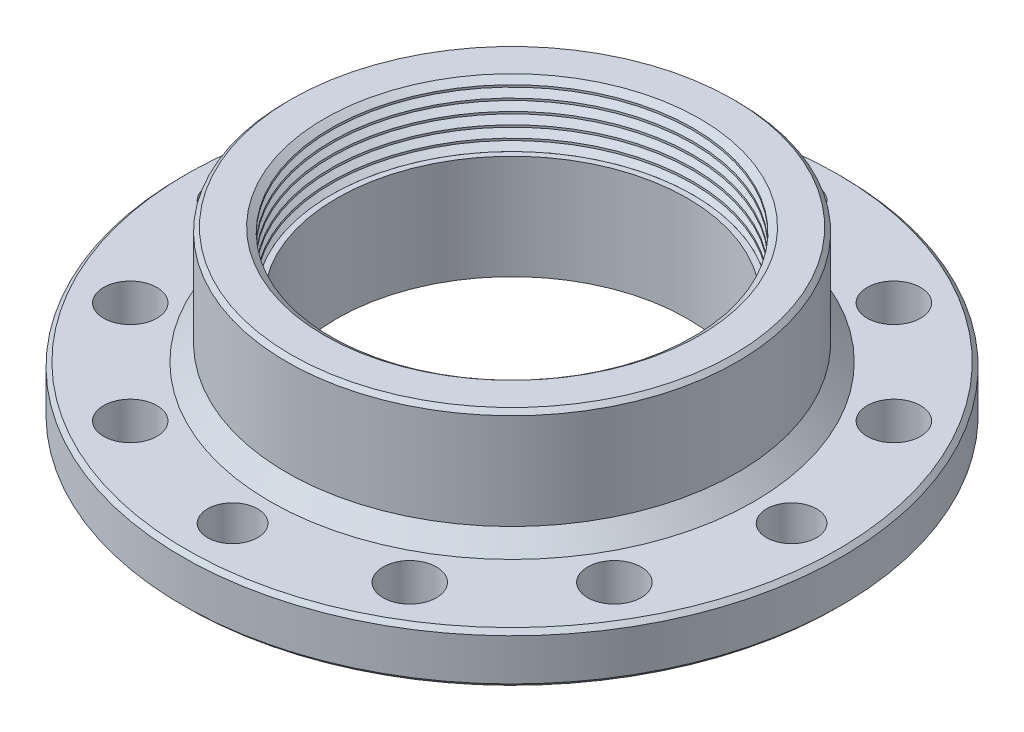
ISO-10303-21;
HEADER;
FILE_DESCRIPTION(('STEP AP214'),'2;1');
FILE_NAME('part.step','',(''),(''),'','','');
FILE_SCHEMA(('AUTOMOTIVE_DESIGN { 1 0 10303 214 1 1 1 1 }'));
ENDSEC;
DATA;
#1=APPLICATION_CONTEXT('core data for automotive mechanical design processes');
#2=APPLICATION_PROTOCOL_DEFINITION('international standard','automotive_design',2000,#1);
#3=PRODUCT_CONTEXT('',#1,'mechanical');
#4=PRODUCT('Part','Part','',(#3));
#5=PRODUCT_RELATED_PRODUCT_CATEGORY('part','',(#4));
#6=PRODUCT_DEFINITION_FORMATION('','',#4);
#7=PRODUCT_DEFINITION_CONTEXT('part definition',#1,'design');
#8=PRODUCT_DEFINITION('design','',#6,#7);
#9=PRODUCT_DEFINITION_SHAPE('','',#8);
#10=(LENGTH_UNIT() NAMED_UNIT(*) SI_UNIT(.MILLI.,.METRE.));
#11=(NAMED_UNIT(*) PLANE_ANGLE_UNIT() SI_UNIT($,.RADIAN.));
#12=(NAMED_UNIT(*) SI_UNIT($,.STERADIAN.) SOLID_ANGLE_UNIT());
#13=UNCERTAINTY_MEASURE_WITH_UNIT(LENGTH_MEASURE(1.E-05),#10,'distance_accuracy_value','');
#14=(GEOMETRIC_REPRESENTATION_CONTEXT(3) GLOBAL_UNCERTAINTY_ASSIGNED_CONTEXT((#13)) GLOBAL_UNIT_ASSIGNED_CONTEXT((#10,
#11,#12)) REPRESENTATION_CONTEXT('',''));
#15=CARTESIAN_POINT('',(0.,0.,0.));
#16=DIRECTION('',(0.,0.,1.));
#17=DIRECTION('',(1.,0.,0.));
#18=AXIS2_PLACEMENT_3D('',#15,#16,#17);
#19=CARTESIAN_POINT('',(0.,12.5,0.));
#20=DIRECTION('',(0.,1.,0.));
#21=DIRECTION('',(0.,0.,1.00000000000001));
#22=AXIS2_PLACEMENT_3D('',#19,#20,#21);
#23=CYLINDRICAL_SURFACE('',#22,21.688);
#24=CARTESIAN_POINT('',(0.,12.5,0.));
#25=DIRECTION('',(0.,1.,0.));
#26=DIRECTION('',(0.,0.,1.00000000000001));
#27=AXIS2_PLACEMENT_3D('',#24,#25,#26);
#28=CIRCLE('',#27,21.688);
#29=CARTESIAN_POINT('',(0.,12.5,21.6880000000001));
#30=VERTEX_POINT('',#29);
#31=EDGE_CURVE('E57',#30,#30,#28,.T.);
#32=ORIENTED_EDGE('',*,*,#31,.F.);
#33=EDGE_LOOP('',(#32));
#34=FACE_BOUND('',#33,.T.);
#35=CARTESIAN_POINT('',(0.,12.5014314789737,0.));
#36=DIRECTION('',(0.,-1.,0.));
#37=DIRECTION('',(0.,0.,-1.00000000000001));
#38=AXIS2_PLACEMENT_3D('',#35,#36,#37);
#39=CIRCLE('',#38,21.688);
#40=CARTESIAN_POINT('',(0.,12.5014314789737,-21.6880000000001));
#41=VERTEX_POINT('',#40);
#42=EDGE_CURVE('E285',#41,#41,#39,.T.);
#43=ORIENTED_EDGE('',*,*,#42,.F.);
#44=EDGE_LOOP('',(#43));
#45=FACE_BOUND('',#44,.T.);
#46=ADVANCED_FACE('F32',(#34,#45),#23,.F.);
#47=CARTESIAN_POINT('',(0.,13.8874314789737,0.));
#48=DIRECTION('',(0.,-1.,0.));
#49=DIRECTION('',(0.,0.,-1.00000000000001));
#50=AXIS2_PLACEMENT_3D('',#47,#48,#49);
#51=CIRCLE('',#50,21.688);
#52=CARTESIAN_POINT('',(0.,13.8874314789737,-21.6880000000001));
#53=VERTEX_POINT('',#52);
#54=EDGE_CURVE('E297',#53,#53,#51,.T.);
#55=ORIENTED_EDGE('',*,*,#54,.F.);
#56=EDGE_LOOP('',(#55));
#57=FACE_BOUND('',#56,.T.);
#58=CARTESIAN_POINT('',(0.,13.6385685210263,0.));
#59=DIRECTION('',(0.,-1.,0.));
#60=DIRECTION('',(0.,0.,-1.00000000000001));
#61=AXIS2_PLACEMENT_3D('',#58,#59,#60);
#62=CIRCLE('',#61,21.688);
#63=CARTESIAN_POINT('',(0.,13.6385685210263,-21.6880000000001));
#64=VERTEX_POINT('',#63);
#65=EDGE_CURVE('E283',#64,#64,#62,.T.);
#66=ORIENTED_EDGE('',*,*,#65,.T.);
#67=EDGE_LOOP('',(#66));
#68=FACE_BOUND('',#67,.T.);
#69=ADVANCED_FACE('F184',(#57,#68),#23,.F.);
#70=CARTESIAN_POINT('',(0.,15.2734314789737,0.));
#71=DIRECTION('',(0.,-1.,0.));
#72=DIRECTION('',(0.,0.,-1.00000000000001));
#73=AXIS2_PLACEMENT_3D('',#70,#71,#72);
#74=CIRCLE('',#73,21.688);
#75=CARTESIAN_POINT('',(0.,15.2734314789737,-21.6880000000001));
#76=VERTEX_POINT('',#75);
#77=EDGE_CURVE('E306',#76,#76,#74,.T.);
#78=ORIENTED_EDGE('',*,*,#77,.F.);
#79=EDGE_LOOP('',(#78));
#80=FACE_BOUND('',#79,.T.);
#81=CARTESIAN_POINT('',(0.,15.0245685210263,0.));
#82=DIRECTION('',(0.,-1.,0.));
#83=DIRECTION('',(0.,0.,-1.00000000000001));
#84=AXIS2_PLACEMENT_3D('',#81,#82,#83);
#85=CIRCLE('',#84,21.688);
#86=CARTESIAN_POINT('',(0.,15.0245685210263,-21.6880000000001));
#87=VERTEX_POINT('',#86);
#88=EDGE_CURVE('E294',#87,#87,#85,.T.);
#89=ORIENTED_EDGE('',*,*,#88,.T.);
#90=EDGE_LOOP('',(#89));
#91=FACE_BOUND('',#90,.T.);
#92=ADVANCED_FACE('F191',(#80,#91),#23,.F.);
#93=CARTESIAN_POINT('',(0.,16.6594314789737,0.));
#94=DIRECTION('',(0.,-1.,0.));
#95=DIRECTION('',(0.,0.,-1.00000000000001));
#96=AXIS2_PLACEMENT_3D('',#93,#94,#95);
#97=CIRCLE('',#96,21.688);
#98=CARTESIAN_POINT('',(0.,16.6594314789737,-21.6880000000001));
#99=VERTEX_POINT('',#98);
#100=EDGE_CURVE('E219',#99,#99,#97,.T.);
#101=ORIENTED_EDGE('',*,*,#100,.F.);
#102=EDGE_LOOP('',(#101));
#103=FACE_BOUND('',#102,.T.);
#104=CARTESIAN_POINT('',(0.,16.4105685210263,0.));
#105=DIRECTION('',(0.,-1.,0.));
#106=DIRECTION('',(0.,0.,-1.00000000000001));
#107=AXIS2_PLACEMENT_3D('',#104,#105,#106);
#108=CIRCLE('',#107,21.688);
#109=CARTESIAN_POINT('',(0.,16.4105685210263,-21.6880000000001));
#110=VERTEX_POINT('',#109);
#111=EDGE_CURVE('E303',#110,#110,#108,.T.);
#112=ORIENTED_EDGE('',*,*,#111,.T.);
#113=EDGE_LOOP('',(#112));
#114=FACE_BOUND('',#113,.T.);
#115=ADVANCED_FACE('F205',(#103,#114),#23,.F.);
#116=CARTESIAN_POINT('',(0.,18.0454314789737,0.));
#117=DIRECTION('',(0.,-1.,0.));
#118=DIRECTION('',(0.,0.,-1.00000000000001));
#119=AXIS2_PLACEMENT_3D('',#116,#117,#118);
#120=CIRCLE('',#119,21.688);
#121=CARTESIAN_POINT('',(0.,18.0454314789737,-21.6880000000001));
#122=VERTEX_POINT('',#121);
#123=EDGE_CURVE('E213',#122,#122,#120,.T.);
#124=ORIENTED_EDGE('',*,*,#123,.F.);
#125=EDGE_LOOP('',(#124));
#126=FACE_BOUND('',#125,.T.);
#127=CARTESIAN_POINT('',(0.,17.7965685210263,0.));
#128=DIRECTION('',(0.,-1.,0.));
#129=DIRECTION('',(0.,0.,-1.00000000000001));
#130=AXIS2_PLACEMENT_3D('',#127,#128,#129);
#131=CIRCLE('',#130,21.688);
#132=CARTESIAN_POINT('',(0.,17.7965685210263,-21.6880000000001));
#133=VERTEX_POINT('',#132);
#134=EDGE_CURVE('E312',#133,#133,#131,.T.);
#135=ORIENTED_EDGE('',*,*,#134,.T.);
#136=EDGE_LOOP('',(#135));
#137=FACE_BOUND('',#136,.T.);
#138=ADVANCED_FACE('F198',(#126,#137),#23,.F.);
#139=CARTESIAN_POINT('',(0.,19.4314314789737,0.));
#140=DIRECTION('',(0.,-1.,0.));
#141=DIRECTION('',(0.,0.,-1.00000000000001));
#142=AXIS2_PLACEMENT_3D('',#139,#140,#141);
#143=CIRCLE('',#142,21.688);
#144=CARTESIAN_POINT('',(0.,19.4314314789737,-21.6880000000001));
#145=VERTEX_POINT('',#144);
#146=EDGE_CURVE('E61',#145,#145,#143,.T.);
#147=ORIENTED_EDGE('',*,*,#146,.F.);
#148=EDGE_LOOP('',(#147));
#149=FACE_BOUND('',#148,.T.);
#150=CARTESIAN_POINT('',(0.,19.1825685210263,0.));
#151=DIRECTION('',(0.,-1.,0.));
#152=DIRECTION('',(0.,0.,-1.00000000000001));
#153=AXIS2_PLACEMENT_3D('',#150,#151,#152);
#154=CIRCLE('',#153,21.688);
#155=CARTESIAN_POINT('',(0.,19.1825685210263,-21.6880000000001));
#156=VERTEX_POINT('',#155);
#157=EDGE_CURVE('E211',#156,#156,#154,.T.);
#158=ORIENTED_EDGE('',*,*,#157,.T.);
#159=EDGE_LOOP('',(#158));
#160=FACE_BOUND('',#159,.T.);
#161=ADVANCED_FACE('F187',(#149,#160),#23,.F.);
#162=CARTESIAN_POINT('',(-25.9763261820386,20.,0.));
#163=DIRECTION('',(0.,-1.,0.));
#164=DIRECTION('',(0.,0.,-1.00000000000001));
#165=AXIS2_PLACEMENT_3D('',#162,#163,#164);
#166=PLANE('',#165);
#167=CARTESIAN_POINT('',(0.,20.,0.));
#168=DIRECTION('',(0.,-1.,0.));
#169=DIRECTION('',(0.,0.,-1.00000000000001));
#170=AXIS2_PLACEMENT_3D('',#167,#168,#169);
#171=CIRCLE('',#170,26.5);
#172=CARTESIAN_POINT('',(0.,20.,-26.5000000000001));
#173=VERTEX_POINT('',#172);
#174=EDGE_CURVE('E10',#173,#173,#171,.F.);
#175=ORIENTED_EDGE('',*,*,#174,.T.);
#176=EDGE_LOOP('',(#175));
#177=FACE_BOUND('',#176,.T.);
#178=CARTESIAN_POINT('',(0.,20.,0.));
#179=DIRECTION('',(0.,-1.,0.));
#180=DIRECTION('',(0.,0.,-1.00000000000001));
#181=AXIS2_PLACEMENT_3D('',#178,#179,#180);
#182=CIRCLE('',#181,22.5);
#183=CARTESIAN_POINT('',(0.,20.,-22.5000000000001));
#184=VERTEX_POINT('',#183);
#185=EDGE_CURVE('E66',#184,#184,#182,.T.);
#186=ORIENTED_EDGE('',*,*,#185,.T.);
#187=EDGE_LOOP('',(#186));
#188=FACE_BOUND('',#187,.T.);
#189=ADVANCED_FACE('F197',(#177,#188),#166,.F.);
#190=CARTESIAN_POINT('',(0.,0.,0.));
#191=DIRECTION('',(0.,-1.,0.));
#192=DIRECTION('',(0.,0.,-1.00000000000001));
#193=AXIS2_PLACEMENT_3D('',#190,#191,#192);
#194=CYLINDRICAL_SURFACE('',#193,21.);
#195=CARTESIAN_POINT('',(0.,0.,0.));
#196=DIRECTION('',(0.,-1.,0.));
#197=DIRECTION('',(0.,0.,-1.00000000000001));
#198=AXIS2_PLACEMENT_3D('',#195,#196,#197);
#199=CIRCLE('',#198,21.);
#200=CARTESIAN_POINT('',(0.,0.,-21.0000000000001));
#201=VERTEX_POINT('',#200);
#202=EDGE_CURVE('E138',#201,#201,#199,.T.);
#203=ORIENTED_EDGE('',*,*,#202,.T.);
#204=EDGE_LOOP('',(#203));
#205=FACE_BOUND('',#204,.T.);
#206=CARTESIAN_POINT('',(0.,12.5,0.));
#207=DIRECTION('',(0.,1.,0.));
#208=DIRECTION('',(0.,0.,1.00000000000001));
#209=AXIS2_PLACEMENT_3D('',#206,#207,#208);
#210=CIRCLE('',#209,21.);
#211=CARTESIAN_POINT('',(0.,12.5,21.0000000000001));
#212=VERTEX_POINT('',#211);
#213=EDGE_CURVE('E36',#212,#212,#210,.F.);
#214=ORIENTED_EDGE('',*,*,#213,.F.);
#215=EDGE_LOOP('',(#214));
#216=FACE_BOUND('',#215,.T.);
#217=ADVANCED_FACE('F179',(#205,#216),#194,.F.);
#218=CARTESIAN_POINT('',(-25.9763261820386,6.,0.));
#219=DIRECTION('',(0.,-1.,0.));
#220=DIRECTION('',(0.,0.,-1.00000000000001));
#221=AXIS2_PLACEMENT_3D('',#218,#219,#220);
#222=PLANE('',#221);
#223=CARTESIAN_POINT('',(0.,6.,0.));
#224=DIRECTION('',(0.,-1.,0.));
#225=DIRECTION('',(0.,0.,-1.00000000000001));
#226=AXIS2_PLACEMENT_3D('',#223,#224,#225);
#227=CIRCLE('',#226,29.);
#228=CARTESIAN_POINT('',(0.,6.,-29.0000000000002));
#229=VERTEX_POINT('',#228);
#230=EDGE_CURVE('E141',#229,#229,#227,.T.);
#231=ORIENTED_EDGE('',*,*,#230,.T.);
#232=EDGE_LOOP('',(#231));
#233=FACE_BOUND('',#232,.T.);
#234=CARTESIAN_POINT('',(0.,6.,0.));
#235=DIRECTION('',(0.,-1.,0.));
#236=DIRECTION('',(0.,0.,-1.00000000000001));
#237=AXIS2_PLACEMENT_3D('',#234,#235,#236);
#238=CIRCLE('',#237,39.);
#239=CARTESIAN_POINT('',(0.,6.,-39.0000000000002));
#240=VERTEX_POINT('',#239);
#241=EDGE_CURVE('E45',#240,#240,#238,.F.);
#242=ORIENTED_EDGE('',*,*,#241,.T.);
#243=EDGE_LOOP('',(#242));
#244=FACE_BOUND('',#243,.T.);
#245=CARTESIAN_POINT('',(16.7500000000001,6.,29.011851026779));
#246=DIRECTION('',(0.,1.,0.));
#247=DIRECTION('',(0.,0.,1.00000000000001));
#248=AXIS2_PLACEMENT_3D('',#245,#246,#247);
#249=CIRCLE('',#248,3.19999999999999);
#250=CARTESIAN_POINT('',(16.7500000000001,6.,32.211851026779));
#251=VERTEX_POINT('',#250);
#252=EDGE_CURVE('E132',#251,#251,#249,.T.);
#253=ORIENTED_EDGE('',*,*,#252,.F.);
#254=EDGE_LOOP('',(#253));
#255=FACE_BOUND('',#254,.T.);
#256=CARTESIAN_POINT('',(29.0118510267789,6.,-16.7500000000001));
#257=DIRECTION('',(0.,1.,0.));
#258=DIRECTION('',(0.,0.,1.00000000000001));
#259=AXIS2_PLACEMENT_3D('',#256,#257,#258);
#260=CIRCLE('',#259,3.19999999999999);
#261=CARTESIAN_POINT('',(29.0118510267789,6.,-13.5500000000001));
#262=VERTEX_POINT('',#261);
#263=EDGE_CURVE('E126',#262,#262,#260,.T.);
#264=ORIENTED_EDGE('',*,*,#263,.F.);
#265=EDGE_LOOP('',(#264));
#266=FACE_BOUND('',#265,.T.);
#267=CARTESIAN_POINT('',(-16.7500000000001,6.,-29.0118510267788));
#268=DIRECTION('',(0.,1.,0.));
#269=DIRECTION('',(0.,0.,1.00000000000001));
#270=AXIS2_PLACEMENT_3D('',#267,#268,#269);
#271=CIRCLE('',#270,3.19999999999999);
#272=CARTESIAN_POINT('',(-16.7500000000001,6.,-25.8118510267788));
#273=VERTEX_POINT('',#272);
#274=EDGE_CURVE('E120',#273,#273,#271,.T.);
#275=ORIENTED_EDGE('',*,*,#274,.F.);
#276=EDGE_LOOP('',(#275));
#277=FACE_BOUND('',#276,.T.);
#278=CARTESIAN_POINT('',(-29.0118510267789,6.,16.7500000000003));
#279=DIRECTION('',(0.,1.,0.));
#280=DIRECTION('',(0.,0.,1.00000000000001));
#281=AXIS2_PLACEMENT_3D('',#278,#279,#280);
#282=CIRCLE('',#281,3.19999999999999);
#283=CARTESIAN_POINT('',(-29.0118510267789,6.,19.9500000000003));
#284=VERTEX_POINT('',#283);
#285=EDGE_CURVE('E114',#284,#284,#282,.T.);
#286=ORIENTED_EDGE('',*,*,#285,.F.);
#287=EDGE_LOOP('',(#286));
#288=FACE_BOUND('',#287,.T.);
#289=CARTESIAN_POINT('',(29.0118510267789,6.,16.7500000000002));
#290=DIRECTION('',(0.,1.,0.));
#291=DIRECTION('',(0.,0.,1.00000000000001));
#292=AXIS2_PLACEMENT_3D('',#289,#290,#291);
#293=CIRCLE('',#292,3.19999999999999);
#294=CARTESIAN_POINT('',(29.0118510267789,6.,19.9500000000002));
#295=VERTEX_POINT('',#294);
#296=EDGE_CURVE('E108',#295,#295,#293,.T.);
#297=ORIENTED_EDGE('',*,*,#296,.F.);
#298=EDGE_LOOP('',(#297));
#299=FACE_BOUND('',#298,.T.);
#300=CARTESIAN_POINT('',(16.7500000000001,6.,-29.0118510267788));
#301=DIRECTION('',(0.,1.,0.));
#302=DIRECTION('',(0.,0.,1.00000000000001));
#303=AXIS2_PLACEMENT_3D('',#300,#301,#302);
#304=CIRCLE('',#303,3.19999999999999);
#305=CARTESIAN_POINT('',(16.7500000000001,6.,-25.8118510267788));
#306=VERTEX_POINT('',#305);
#307=EDGE_CURVE('E102',#306,#306,#304,.T.);
#308=ORIENTED_EDGE('',*,*,#307,.F.);
#309=EDGE_LOOP('',(#308));
#310=FACE_BOUND('',#309,.T.);
#311=CARTESIAN_POINT('',(-29.0118510267789,6.,-16.75));
#312=DIRECTION('',(0.,1.,0.));
#313=DIRECTION('',(0.,0.,1.00000000000001));
#314=AXIS2_PLACEMENT_3D('',#311,#312,#313);
#315=CIRCLE('',#314,3.19999999999999);
#316=CARTESIAN_POINT('',(-29.0118510267789,6.,-13.55));
#317=VERTEX_POINT('',#316);
#318=EDGE_CURVE('E96',#317,#317,#315,.T.);
#319=ORIENTED_EDGE('',*,*,#318,.F.);
#320=EDGE_LOOP('',(#319));
#321=FACE_BOUND('',#320,.T.);
#322=CARTESIAN_POINT('',(-16.7500000000001,6.,29.0118510267789));
#323=DIRECTION('',(0.,1.,0.));
#324=DIRECTION('',(0.,0.,1.00000000000001));
#325=AXIS2_PLACEMENT_3D('',#322,#323,#324);
#326=CIRCLE('',#325,3.19999999999999);
#327=CARTESIAN_POINT('',(-16.7500000000001,6.,32.2118510267789));
#328=VERTEX_POINT('',#327);
#329=EDGE_CURVE('E88',#328,#328,#326,.T.);
#330=ORIENTED_EDGE('',*,*,#329,.F.);
#331=EDGE_LOOP('',(#330));
#332=FACE_BOUND('',#331,.T.);
#333=CARTESIAN_POINT('',(-33.5000000000002,6.,0.));
#334=DIRECTION('',(0.,1.,0.));
#335=DIRECTION('',(0.,0.,1.00000000000001));
#336=AXIS2_PLACEMENT_3D('',#333,#334,#335);
#337=CIRCLE('',#336,3.);
#338=CARTESIAN_POINT('',(-33.5000000000002,6.,3.00000000000002));
#339=VERTEX_POINT('',#338);
#340=EDGE_CURVE('E82',#339,#339,#337,.T.);
#341=ORIENTED_EDGE('',*,*,#340,.F.);
#342=EDGE_LOOP('',(#341));
#343=FACE_BOUND('',#342,.T.);
#344=CARTESIAN_POINT('',(0.,6.,-33.5000000000001));
#345=DIRECTION('',(0.,1.,0.));
#346=DIRECTION('',(0.,0.,1.00000000000001));
#347=AXIS2_PLACEMENT_3D('',#344,#345,#346);
#348=CIRCLE('',#347,3.);
#349=CARTESIAN_POINT('',(0.,6.,-30.5000000000001));
#350=VERTEX_POINT('',#349);
#351=EDGE_CURVE('E76',#350,#350,#348,.T.);
#352=ORIENTED_EDGE('',*,*,#351,.F.);
#353=EDGE_LOOP('',(#352));
#354=FACE_BOUND('',#353,.T.);
#355=CARTESIAN_POINT('',(33.5000000000002,6.,0.));
#356=DIRECTION('',(0.,1.,0.));
#357=DIRECTION('',(0.,0.,1.00000000000001));
#358=AXIS2_PLACEMENT_3D('',#355,#356,#357);
#359=CIRCLE('',#358,3.);
#360=CARTESIAN_POINT('',(33.5000000000002,6.,3.00000000000003));
#361=VERTEX_POINT('',#360);
#362=EDGE_CURVE('E71',#361,#361,#359,.T.);
#363=ORIENTED_EDGE('',*,*,#362,.F.);
#364=EDGE_LOOP('',(#363));
#365=FACE_BOUND('',#364,.T.);
#366=CARTESIAN_POINT('',(0.,6.,33.5000000000003));
#367=DIRECTION('',(0.,1.,0.));
#368=DIRECTION('',(0.,0.,1.00000000000001));
#369=AXIS2_PLACEMENT_3D('',#366,#367,#368);
#370=CIRCLE('',#369,3.);
#371=CARTESIAN_POINT('',(0.,6.,36.5000000000003));
#372=VERTEX_POINT('',#371);
#373=EDGE_CURVE('E50',#372,#372,#370,.T.);
#374=ORIENTED_EDGE('',*,*,#373,.F.);
#375=EDGE_LOOP('',(#374));
#376=FACE_BOUND('',#375,.T.);
#377=CARTESIAN_POINT('',(-23.6880771697496,6.,-23.6880771697494));
#378=DIRECTION('',(0.,-1.,0.));
#379=DIRECTION('',(0.,0.,-1.00000000000001));
#380=AXIS2_PLACEMENT_3D('',#377,#378,#379);
#381=CIRCLE('',#380,0.500000000000001);
#382=CARTESIAN_POINT('',(-23.6880771697496,6.,-24.1880771697494));
#383=VERTEX_POINT('',#382);
#384=EDGE_CURVE('E48',#383,#383,#381,.F.);
#385=ORIENTED_EDGE('',*,*,#384,.F.);
#386=EDGE_LOOP('',(#385));
#387=FACE_BOUND('',#386,.T.);
#388=ADVANCED_FACE('F158',(#233,#244,#255,#266,#277,#288,#299,#310,#321,#332,#343,#354,#365,
#376,#387),#222,.F.);
#389=CARTESIAN_POINT('',(0.,0.,0.));
#390=DIRECTION('',(0.,-1.,0.));
#391=DIRECTION('',(0.,0.,-1.00000000000001));
#392=AXIS2_PLACEMENT_3D('',#389,#390,#391);
#393=CYLINDRICAL_SURFACE('',#392,39.5);
#394=CARTESIAN_POINT('',(0.,0.49999999999998,0.));
#395=DIRECTION('',(0.,-1.,0.));
#396=DIRECTION('',(0.,0.,-1.00000000000001));
#397=AXIS2_PLACEMENT_3D('',#394,#395,#396);
#398=CIRCLE('',#397,39.5);
#399=CARTESIAN_POINT('',(0.,0.49999999999998,-39.5000000000002));
#400=VERTEX_POINT('',#399);
#401=EDGE_CURVE('E153',#400,#400,#398,.F.);
#402=ORIENTED_EDGE('',*,*,#401,.T.);
#403=EDGE_LOOP('',(#402));
#404=FACE_BOUND('',#403,.T.);
#405=CARTESIAN_POINT('',(0.,5.49999999999998,0.));
#406=DIRECTION('',(0.,-1.,0.));
#407=DIRECTION('',(0.,0.,-1.00000000000001));
#408=AXIS2_PLACEMENT_3D('',#405,#406,#407);
#409=CIRCLE('',#408,39.5);
#410=CARTESIAN_POINT('',(0.,5.49999999999998,-39.5000000000002));
#411=VERTEX_POINT('',#410);
#412=EDGE_CURVE('E150',#411,#411,#409,.T.);
#413=ORIENTED_EDGE('',*,*,#412,.T.);
#414=EDGE_LOOP('',(#413));
#415=FACE_BOUND('',#414,.T.);
#416=ADVANCED_FACE('F167',(#404,#415),#393,.T.);
#417=CARTESIAN_POINT('',(-25.9763261820386,0.,0.));
#418=DIRECTION('',(0.,-1.,0.));
#419=DIRECTION('',(0.,0.,-1.00000000000001));
#420=AXIS2_PLACEMENT_3D('',#417,#418,#419);
#421=PLANE('',#420);
#422=CARTESIAN_POINT('',(0.,0.,33.5000000000003));
#423=DIRECTION('',(0.,1.,0.));
#424=DIRECTION('',(0.,0.,1.00000000000001));
#425=AXIS2_PLACEMENT_3D('',#422,#423,#424);
#426=CIRCLE('',#425,3.);
#427=CARTESIAN_POINT('',(0.,0.,36.5000000000003));
#428=VERTEX_POINT('',#427);
#429=EDGE_CURVE('E54',#428,#428,#426,.T.);
#430=ORIENTED_EDGE('',*,*,#429,.T.);
#431=EDGE_LOOP('',(#430));
#432=FACE_BOUND('',#431,.T.);
#433=CARTESIAN_POINT('',(33.5000000000002,0.,0.));
#434=DIRECTION('',(0.,1.,0.));
#435=DIRECTION('',(0.,0.,1.00000000000001));
#436=AXIS2_PLACEMENT_3D('',#433,#434,#435);
#437=CIRCLE('',#436,3.);
#438=CARTESIAN_POINT('',(33.5000000000002,0.,3.00000000000003));
#439=VERTEX_POINT('',#438);
#440=EDGE_CURVE('E73',#439,#439,#437,.T.);
#441=ORIENTED_EDGE('',*,*,#440,.T.);
#442=EDGE_LOOP('',(#441));
#443=FACE_BOUND('',#442,.T.);
#444=CARTESIAN_POINT('',(0.,0.,-33.5000000000001));
#445=DIRECTION('',(0.,1.,0.));
#446=DIRECTION('',(0.,0.,1.00000000000001));
#447=AXIS2_PLACEMENT_3D('',#444,#445,#446);
#448=CIRCLE('',#447,3.);
#449=CARTESIAN_POINT('',(0.,0.,-30.5000000000001));
#450=VERTEX_POINT('',#449);
#451=EDGE_CURVE('E79',#450,#450,#448,.T.);
#452=ORIENTED_EDGE('',*,*,#451,.T.);
#453=EDGE_LOOP('',(#452));
#454=FACE_BOUND('',#453,.T.);
#455=CARTESIAN_POINT('',(-33.5000000000002,0.,0.));
#456=DIRECTION('',(0.,1.,0.));
#457=DIRECTION('',(0.,0.,1.00000000000001));
#458=AXIS2_PLACEMENT_3D('',#455,#456,#457);
#459=CIRCLE('',#458,3.);
#460=CARTESIAN_POINT('',(-33.5000000000002,0.,3.00000000000002));
#461=VERTEX_POINT('',#460);
#462=EDGE_CURVE('E85',#461,#461,#459,.T.);
#463=ORIENTED_EDGE('',*,*,#462,.T.);
#464=EDGE_LOOP('',(#463));
#465=FACE_BOUND('',#464,.T.);
#466=CARTESIAN_POINT('',(-16.7500000000001,0.,29.0118510267789));
#467=DIRECTION('',(0.,1.,0.));
#468=DIRECTION('',(0.,0.,1.00000000000001));
#469=AXIS2_PLACEMENT_3D('',#466,#467,#468);
#470=CIRCLE('',#469,3.2);
#471=CARTESIAN_POINT('',(-16.7500000000001,0.,32.2118510267789));
#472=VERTEX_POINT('',#471);
#473=EDGE_CURVE('E93',#472,#472,#470,.T.);
#474=ORIENTED_EDGE('',*,*,#473,.T.);
#475=EDGE_LOOP('',(#474));
#476=FACE_BOUND('',#475,.T.);
#477=CARTESIAN_POINT('',(-29.0118510267789,0.,-16.75));
#478=DIRECTION('',(0.,1.,0.));
#479=DIRECTION('',(0.,0.,1.00000000000001));
#480=AXIS2_PLACEMENT_3D('',#477,#478,#479);
#481=CIRCLE('',#480,3.2);
#482=CARTESIAN_POINT('',(-29.0118510267789,0.,-13.55));
#483=VERTEX_POINT('',#482);
#484=EDGE_CURVE('E99',#483,#483,#481,.T.);
#485=ORIENTED_EDGE('',*,*,#484,.T.);
#486=EDGE_LOOP('',(#485));
#487=FACE_BOUND('',#486,.T.);
#488=CARTESIAN_POINT('',(16.7500000000001,0.,-29.0118510267788));
#489=DIRECTION('',(0.,1.,0.));
#490=DIRECTION('',(0.,0.,1.00000000000001));
#491=AXIS2_PLACEMENT_3D('',#488,#489,#490);
#492=CIRCLE('',#491,3.2);
#493=CARTESIAN_POINT('',(16.7500000000001,0.,-25.8118510267788));
#494=VERTEX_POINT('',#493);
#495=EDGE_CURVE('E105',#494,#494,#492,.T.);
#496=ORIENTED_EDGE('',*,*,#495,.T.);
#497=EDGE_LOOP('',(#496));
#498=FACE_BOUND('',#497,.T.);
#499=CARTESIAN_POINT('',(29.0118510267789,0.,16.7500000000002));
#500=DIRECTION('',(0.,1.,0.));
#501=DIRECTION('',(0.,0.,1.00000000000001));
#502=AXIS2_PLACEMENT_3D('',#499,#500,#501);
#503=CIRCLE('',#502,3.2);
#504=CARTESIAN_POINT('',(29.0118510267789,0.,19.9500000000002));
#505=VERTEX_POINT('',#504);
#506=EDGE_CURVE('E111',#505,#505,#503,.T.);
#507=ORIENTED_EDGE('',*,*,#506,.T.);
#508=EDGE_LOOP('',(#507));
#509=FACE_BOUND('',#508,.T.);
#510=CARTESIAN_POINT('',(-29.0118510267789,0.,16.7500000000003));
#511=DIRECTION('',(0.,1.,0.));
#512=DIRECTION('',(0.,0.,1.00000000000001));
#513=AXIS2_PLACEMENT_3D('',#510,#511,#512);
#514=CIRCLE('',#513,3.2);
#515=CARTESIAN_POINT('',(-29.0118510267789,0.,19.9500000000003));
#516=VERTEX_POINT('',#515);
#517=EDGE_CURVE('E117',#516,#516,#514,.T.);
#518=ORIENTED_EDGE('',*,*,#517,.T.);
#519=EDGE_LOOP('',(#518));
#520=FACE_BOUND('',#519,.T.);
#521=CARTESIAN_POINT('',(-16.7500000000001,0.,-29.0118510267788));
#522=DIRECTION('',(0.,1.,0.));
#523=DIRECTION('',(0.,0.,1.00000000000001));
#524=AXIS2_PLACEMENT_3D('',#521,#522,#523);
#525=CIRCLE('',#524,3.2);
#526=CARTESIAN_POINT('',(-16.7500000000001,0.,-25.8118510267788));
#527=VERTEX_POINT('',#526);
#528=EDGE_CURVE('E123',#527,#527,#525,.T.);
#529=ORIENTED_EDGE('',*,*,#528,.T.);
#530=EDGE_LOOP('',(#529));
#531=FACE_BOUND('',#530,.T.);
#532=CARTESIAN_POINT('',(29.0118510267789,0.,-16.7500000000001));
#533=DIRECTION('',(0.,1.,0.));
#534=DIRECTION('',(0.,0.,1.00000000000001));
#535=AXIS2_PLACEMENT_3D('',#532,#533,#534);
#536=CIRCLE('',#535,3.2);
#537=CARTESIAN_POINT('',(29.0118510267789,0.,-13.5500000000001));
#538=VERTEX_POINT('',#537);
#539=EDGE_CURVE('E129',#538,#538,#536,.T.);
#540=ORIENTED_EDGE('',*,*,#539,.T.);
#541=EDGE_LOOP('',(#540));
#542=FACE_BOUND('',#541,.T.);
#543=CARTESIAN_POINT('',(16.7500000000001,0.,29.011851026779));
#544=DIRECTION('',(0.,1.,0.));
#545=DIRECTION('',(0.,0.,1.00000000000001));
#546=AXIS2_PLACEMENT_3D('',#543,#544,#545);
#547=CIRCLE('',#546,3.2);
#548=CARTESIAN_POINT('',(16.7500000000001,0.,32.211851026779));
#549=VERTEX_POINT('',#548);
#550=EDGE_CURVE('E135',#549,#549,#547,.T.);
#551=ORIENTED_EDGE('',*,*,#550,.T.);
#552=EDGE_LOOP('',(#551));
#553=FACE_BOUND('',#552,.T.);
#554=CARTESIAN_POINT('',(0.,0.,0.));
#555=DIRECTION('',(0.,-1.,0.));
#556=DIRECTION('',(0.,0.,-1.00000000000001));
#557=AXIS2_PLACEMENT_3D('',#554,#555,#556);
#558=CIRCLE('',#557,39.);
#559=CARTESIAN_POINT('',(0.,0.,-39.0000000000003));
#560=VERTEX_POINT('',#559);
#561=EDGE_CURVE('E147',#560,#560,#558,.T.);
#562=ORIENTED_EDGE('',*,*,#561,.T.);
#563=EDGE_LOOP('',(#562));
#564=FACE_BOUND('',#563,.T.);
#565=ORIENTED_EDGE('',*,*,#202,.F.);
#566=EDGE_LOOP('',(#565));
#567=FACE_BOUND('',#566,.T.);
#568=ADVANCED_FACE('F169',(#432,#443,#454,#465,#476,#487,#498,#509,#520,#531,#542,#553,#564,
#567),#421,.T.);
#569=CARTESIAN_POINT('',(0.,0.,0.));
#570=DIRECTION('',(0.,-1.,0.));
#571=DIRECTION('',(0.,0.,-1.00000000000001));
#572=AXIS2_PLACEMENT_3D('',#569,#570,#571);
#573=CYLINDRICAL_SURFACE('',#572,27.);
#574=CARTESIAN_POINT('',(0.,19.5,0.));
#575=DIRECTION('',(0.,-1.,0.));
#576=DIRECTION('',(0.,0.,-1.00000000000001));
#577=AXIS2_PLACEMENT_3D('',#574,#575,#576);
#578=CIRCLE('',#577,27.);
#579=CARTESIAN_POINT('',(0.,19.5,-27.0000000000002));
#580=VERTEX_POINT('',#579);
#581=EDGE_CURVE('E40',#580,#580,#578,.T.);
#582=ORIENTED_EDGE('',*,*,#581,.T.);
#583=EDGE_LOOP('',(#582));
#584=FACE_BOUND('',#583,.T.);
#585=CARTESIAN_POINT('',(0.,7.99999999999999,0.));
#586=DIRECTION('',(0.,-1.,0.));
#587=DIRECTION('',(0.,0.,-1.00000000000001));
#588=AXIS2_PLACEMENT_3D('',#585,#586,#587);
#589=CIRCLE('',#588,27.);
#590=CARTESIAN_POINT('',(0.,7.99999999999999,-27.0000000000002));
#591=VERTEX_POINT('',#590);
#592=EDGE_CURVE('E144',#591,#591,#589,.F.);
#593=ORIENTED_EDGE('',*,*,#592,.T.);
#594=EDGE_LOOP('',(#593));
#595=FACE_BOUND('',#594,.T.);
#596=ADVANCED_FACE('F176',(#584,#595),#573,.T.);
#597=CARTESIAN_POINT('',(0.,6.,0.));
#598=DIRECTION('',(0.,-1.,0.));
#599=DIRECTION('',(0.,0.,-1.00000000000001));
#600=AXIS2_PLACEMENT_3D('',#597,#598,#599);
#601=CONICAL_SURFACE('',#600,29.,0.785398163397451);
#602=ORIENTED_EDGE('',*,*,#592,.F.);
#603=EDGE_LOOP('',(#602));
#604=FACE_BOUND('',#603,.T.);
#605=ORIENTED_EDGE('',*,*,#230,.F.);
#606=EDGE_LOOP('',(#605));
#607=FACE_BOUND('',#606,.T.);
#608=ADVANCED_FACE('F564',(#604,#607),#601,.T.);
#609=CARTESIAN_POINT('',(0.,0.,0.));
#610=DIRECTION('',(0.,1.,0.));
#611=DIRECTION('',(0.,0.,1.00000000000001));
#612=AXIS2_PLACEMENT_3D('',#609,#610,#611);
#613=CONICAL_SURFACE('',#612,39.,0.785398163397441);
#614=ORIENTED_EDGE('',*,*,#401,.F.);
#615=EDGE_LOOP('',(#614));
#616=FACE_BOUND('',#615,.T.);
#617=ORIENTED_EDGE('',*,*,#561,.F.);
#618=EDGE_LOOP('',(#617));
#619=FACE_BOUND('',#618,.T.);
#620=ADVANCED_FACE('F164',(#616,#619),#613,.T.);
#621=CARTESIAN_POINT('',(0.,5.49999999999998,0.));
#622=DIRECTION('',(0.,-1.,0.));
#623=DIRECTION('',(0.,0.,-1.00000000000001));
#624=AXIS2_PLACEMENT_3D('',#621,#622,#623);
#625=CONICAL_SURFACE('',#624,39.5,0.785398163397441);
#626=ORIENTED_EDGE('',*,*,#241,.F.);
#627=EDGE_LOOP('',(#626));
#628=FACE_BOUND('',#627,.T.);
#629=ORIENTED_EDGE('',*,*,#412,.F.);
#630=EDGE_LOOP('',(#629));
#631=FACE_BOUND('',#630,.T.);
#632=ADVANCED_FACE('F161',(#628,#631),#625,.T.);
#633=CARTESIAN_POINT('',(0.,19.5,0.));
#634=DIRECTION('',(0.,-1.,0.));
#635=DIRECTION('',(0.,0.,-1.00000000000001));
#636=AXIS2_PLACEMENT_3D('',#633,#634,#635);
#637=CONICAL_SURFACE('',#636,27.,0.785398163397459);
#638=ORIENTED_EDGE('',*,*,#174,.F.);
#639=EDGE_LOOP('',(#638));
#640=FACE_BOUND('',#639,.T.);
#641=ORIENTED_EDGE('',*,*,#581,.F.);
#642=EDGE_LOOP('',(#641));
#643=FACE_BOUND('',#642,.T.);
#644=ADVANCED_FACE('F34',(#640,#643),#637,.T.);
#645=CARTESIAN_POINT('',(16.7500000000001,6.,29.011851026779));
#646=DIRECTION('',(0.,1.,0.));
#647=DIRECTION('',(0.,0.,1.00000000000001));
#648=AXIS2_PLACEMENT_3D('',#645,#646,#647);
#649=CYLINDRICAL_SURFACE('',#648,3.19999999999999);
#650=ORIENTED_EDGE('',*,*,#550,.F.);
#651=EDGE_LOOP('',(#650));
#652=FACE_BOUND('',#651,.T.);
#653=ORIENTED_EDGE('',*,*,#252,.T.);
#654=EDGE_LOOP('',(#653));
#655=FACE_BOUND('',#654,.T.);
#656=ADVANCED_FACE('F531',(#652,#655),#649,.F.);
#657=CARTESIAN_POINT('',(29.0118510267789,6.,-16.7500000000001));
#658=DIRECTION('',(0.,1.,0.));
#659=DIRECTION('',(0.,0.,1.00000000000001));
#660=AXIS2_PLACEMENT_3D('',#657,#658,#659);
#661=CYLINDRICAL_SURFACE('',#660,3.19999999999999);
#662=ORIENTED_EDGE('',*,*,#539,.F.);
#663=EDGE_LOOP('',(#662));
#664=FACE_BOUND('',#663,.T.);
#665=ORIENTED_EDGE('',*,*,#263,.T.);
#666=EDGE_LOOP('',(#665));
#667=FACE_BOUND('',#666,.T.);
#668=ADVANCED_FACE('F521',(#664,#667),#661,.F.);
#669=CARTESIAN_POINT('',(-16.7500000000001,6.,-29.0118510267788));
#670=DIRECTION('',(0.,1.,0.));
#671=DIRECTION('',(0.,0.,1.00000000000001));
#672=AXIS2_PLACEMENT_3D('',#669,#670,#671);
#673=CYLINDRICAL_SURFACE('',#672,3.19999999999999);
#674=ORIENTED_EDGE('',*,*,#528,.F.);
#675=EDGE_LOOP('',(#674));
#676=FACE_BOUND('',#675,.T.);
#677=ORIENTED_EDGE('',*,*,#274,.T.);
#678=EDGE_LOOP('',(#677));
#679=FACE_BOUND('',#678,.T.);
#680=ADVANCED_FACE('F511',(#676,#679),#673,.F.);
#681=CARTESIAN_POINT('',(-29.0118510267789,6.,16.7500000000003));
#682=DIRECTION('',(0.,1.,0.));
#683=DIRECTION('',(0.,0.,1.00000000000001));
#684=AXIS2_PLACEMENT_3D('',#681,#682,#683);
#685=CYLINDRICAL_SURFACE('',#684,3.19999999999999);
#686=ORIENTED_EDGE('',*,*,#517,.F.);
#687=EDGE_LOOP('',(#686));
#688=FACE_BOUND('',#687,.T.);
#689=ORIENTED_EDGE('',*,*,#285,.T.);
#690=EDGE_LOOP('',(#689));
#691=FACE_BOUND('',#690,.T.);
#692=ADVANCED_FACE('F501',(#688,#691),#685,.F.);
#693=CARTESIAN_POINT('',(29.0118510267789,6.,16.7500000000002));
#694=DIRECTION('',(0.,1.,0.));
#695=DIRECTION('',(0.,0.,1.00000000000001));
#696=AXIS2_PLACEMENT_3D('',#693,#694,#695);
#697=CYLINDRICAL_SURFACE('',#696,3.19999999999999);
#698=ORIENTED_EDGE('',*,*,#506,.F.);
#699=EDGE_LOOP('',(#698));
#700=FACE_BOUND('',#699,.T.);
#701=ORIENTED_EDGE('',*,*,#296,.T.);
#702=EDGE_LOOP('',(#701));
#703=FACE_BOUND('',#702,.T.);
#704=ADVANCED_FACE('F491',(#700,#703),#697,.F.);
#705=CARTESIAN_POINT('',(16.7500000000001,6.,-29.0118510267788));
#706=DIRECTION('',(0.,1.,0.));
#707=DIRECTION('',(0.,0.,1.00000000000001));
#708=AXIS2_PLACEMENT_3D('',#705,#706,#707);
#709=CYLINDRICAL_SURFACE('',#708,3.19999999999999);
#710=ORIENTED_EDGE('',*,*,#495,.F.);
#711=EDGE_LOOP('',(#710));
#712=FACE_BOUND('',#711,.T.);
#713=ORIENTED_EDGE('',*,*,#307,.T.);
#714=EDGE_LOOP('',(#713));
#715=FACE_BOUND('',#714,.T.);
#716=ADVANCED_FACE('F481',(#712,#715),#709,.F.);
#717=CARTESIAN_POINT('',(-29.0118510267789,6.,-16.75));
#718=DIRECTION('',(0.,1.,0.));
#719=DIRECTION('',(0.,0.,1.00000000000001));
#720=AXIS2_PLACEMENT_3D('',#717,#718,#719);
#721=CYLINDRICAL_SURFACE('',#720,3.19999999999999);
#722=ORIENTED_EDGE('',*,*,#484,.F.);
#723=EDGE_LOOP('',(#722));
#724=FACE_BOUND('',#723,.T.);
#725=ORIENTED_EDGE('',*,*,#318,.T.);
#726=EDGE_LOOP('',(#725));
#727=FACE_BOUND('',#726,.T.);
#728=ADVANCED_FACE('F471',(#724,#727),#721,.F.);
#729=CARTESIAN_POINT('',(-16.7500000000001,6.,29.0118510267789));
#730=DIRECTION('',(0.,1.,0.));
#731=DIRECTION('',(0.,0.,1.00000000000001));
#732=AXIS2_PLACEMENT_3D('',#729,#730,#731);
#733=CYLINDRICAL_SURFACE('',#732,3.19999999999999);
#734=ORIENTED_EDGE('',*,*,#473,.F.);
#735=EDGE_LOOP('',(#734));
#736=FACE_BOUND('',#735,.T.);
#737=ORIENTED_EDGE('',*,*,#329,.T.);
#738=EDGE_LOOP('',(#737));
#739=FACE_BOUND('',#738,.T.);
#740=ADVANCED_FACE('F461',(#736,#739),#733,.F.);
#741=CARTESIAN_POINT('',(-33.5000000000002,0.,0.));
#742=DIRECTION('',(0.,1.,0.));
#743=DIRECTION('',(0.,0.,1.00000000000001));
#744=AXIS2_PLACEMENT_3D('',#741,#742,#743);
#745=CYLINDRICAL_SURFACE('',#744,3.);
#746=ORIENTED_EDGE('',*,*,#462,.F.);
#747=EDGE_LOOP('',(#746));
#748=FACE_BOUND('',#747,.T.);
#749=ORIENTED_EDGE('',*,*,#340,.T.);
#750=EDGE_LOOP('',(#749));
#751=FACE_BOUND('',#750,.T.);
#752=ADVANCED_FACE('F451',(#748,#751),#745,.F.);
#753=CARTESIAN_POINT('',(0.,0.,-33.5000000000001));
#754=DIRECTION('',(0.,1.,0.));
#755=DIRECTION('',(0.,0.,1.00000000000001));
#756=AXIS2_PLACEMENT_3D('',#753,#754,#755);
#757=CYLINDRICAL_SURFACE('',#756,3.);
#758=ORIENTED_EDGE('',*,*,#451,.F.);
#759=EDGE_LOOP('',(#758));
#760=FACE_BOUND('',#759,.T.);
#761=ORIENTED_EDGE('',*,*,#351,.T.);
#762=EDGE_LOOP('',(#761));
#763=FACE_BOUND('',#762,.T.);
#764=ADVANCED_FACE('F441',(#760,#763),#757,.F.);
#765=CARTESIAN_POINT('',(33.5000000000002,0.,0.));
#766=DIRECTION('',(0.,1.,0.));
#767=DIRECTION('',(0.,0.,1.00000000000001));
#768=AXIS2_PLACEMENT_3D('',#765,#766,#767);
#769=CYLINDRICAL_SURFACE('',#768,3.);
#770=ORIENTED_EDGE('',*,*,#440,.F.);
#771=EDGE_LOOP('',(#770));
#772=FACE_BOUND('',#771,.T.);
#773=ORIENTED_EDGE('',*,*,#362,.T.);
#774=EDGE_LOOP('',(#773));
#775=FACE_BOUND('',#774,.T.);
#776=ADVANCED_FACE('F431',(#772,#775),#769,.F.);
#777=CARTESIAN_POINT('',(0.,0.,33.5000000000003));
#778=DIRECTION('',(0.,1.,0.));
#779=DIRECTION('',(0.,0.,1.00000000000001));
#780=AXIS2_PLACEMENT_3D('',#777,#778,#779);
#781=CYLINDRICAL_SURFACE('',#780,3.);
#782=ORIENTED_EDGE('',*,*,#429,.F.);
#783=EDGE_LOOP('',(#782));
#784=FACE_BOUND('',#783,.T.);
#785=ORIENTED_EDGE('',*,*,#373,.T.);
#786=EDGE_LOOP('',(#785));
#787=FACE_BOUND('',#786,.T.);
#788=ADVANCED_FACE('F422',(#784,#787),#781,.F.);
#789=CARTESIAN_POINT('',(-23.6880771697496,6.,-23.6880771697494));
#790=DIRECTION('',(0.707106781186552,0.,0.707106781186549));
#791=DIRECTION('',(-0.707106781186549,0.,0.707106781186552));
#792=AXIS2_PLACEMENT_3D('',#789,#790,#791);
#793=SPHERICAL_SURFACE('',#792,0.500000000000001);
#794=CARTESIAN_POINT('',(-23.6880771697496,6.,-23.6880771697494));
#795=DIRECTION('',(0.,-1.,0.));
#796=DIRECTION('',(0.,0.,-1.));
#797=AXIS2_PLACEMENT_3D('',#794,#795,#796);
#798=SPHERICAL_SURFACE('',#797,0.500000000000001);
#799=ORIENTED_EDGE('',*,*,#384,.T.);
#800=EDGE_LOOP('',(#799));
#801=FACE_BOUND('',#800,.T.);
#802=ADVANCED_FACE('F239',(#801),#798,.F.);
#803=CARTESIAN_POINT('',(0.,12.5,0.));
#804=DIRECTION('',(0.,1.,0.));
#805=DIRECTION('',(0.,0.,1.00000000000001));
#806=AXIS2_PLACEMENT_3D('',#803,#804,#805);
#807=PLANE('',#806);
#808=ORIENTED_EDGE('',*,*,#31,.T.);
#809=EDGE_LOOP('',(#808));
#810=FACE_BOUND('',#809,.T.);
#811=ORIENTED_EDGE('',*,*,#213,.T.);
#812=EDGE_LOOP('',(#811));
#813=FACE_BOUND('',#812,.T.);
#814=ADVANCED_FACE('F229',(#810,#813),#807,.T.);
#815=CARTESIAN_POINT('',(0.,20.,0.));
#816=DIRECTION('',(0.,1.,0.));
#817=DIRECTION('',(0.,0.,1.00000000000001));
#818=AXIS2_PLACEMENT_3D('',#815,#816,#817);
#819=CONICAL_SURFACE('',#818,22.5,0.95993108859688);
#820=ORIENTED_EDGE('',*,*,#146,.T.);
#821=EDGE_LOOP('',(#820));
#822=FACE_BOUND('',#821,.T.);
#823=ORIENTED_EDGE('',*,*,#185,.F.);
#824=EDGE_LOOP('',(#823));
#825=FACE_BOUND('',#824,.T.);
#826=ADVANCED_FACE('F226',(#822,#825),#819,.F.);
#827=CARTESIAN_POINT('',(0.,18.614,0.));
#828=DIRECTION('',(0.,1.,0.));
#829=DIRECTION('',(0.,0.,1.00000000000001));
#830=AXIS2_PLACEMENT_3D('',#827,#828,#829);
#831=CONICAL_SURFACE('',#830,22.5,0.95993108859688);
#832=ORIENTED_EDGE('',*,*,#123,.T.);
#833=EDGE_LOOP('',(#832));
#834=FACE_BOUND('',#833,.T.);
#835=CARTESIAN_POINT('',(0.,18.614,0.));
#836=DIRECTION('',(0.,-1.,0.));
#837=DIRECTION('',(0.,0.,-1.00000000000001));
#838=AXIS2_PLACEMENT_3D('',#835,#836,#837);
#839=CIRCLE('',#838,22.5);
#840=CARTESIAN_POINT('',(0.,18.614,-22.5000000000001));
#841=VERTEX_POINT('',#840);
#842=EDGE_CURVE('E214',#841,#841,#839,.T.);
#843=ORIENTED_EDGE('',*,*,#842,.F.);
#844=EDGE_LOOP('',(#843));
#845=FACE_BOUND('',#844,.T.);
#846=ADVANCED_FACE('F228',(#834,#845),#831,.F.);
#847=CARTESIAN_POINT('',(0.,19.1825685210263,0.));
#848=DIRECTION('',(0.,-1.,0.));
#849=DIRECTION('',(0.,0.,-1.00000000000001));
#850=AXIS2_PLACEMENT_3D('',#847,#848,#849);
#851=CONICAL_SURFACE('',#850,21.688,0.95993108859688);
#852=ORIENTED_EDGE('',*,*,#842,.T.);
#853=EDGE_LOOP('',(#852));
#854=FACE_BOUND('',#853,.T.);
#855=ORIENTED_EDGE('',*,*,#157,.F.);
#856=EDGE_LOOP('',(#855));
#857=FACE_BOUND('',#856,.T.);
#858=ADVANCED_FACE('F236',(#854,#857),#851,.F.);
#859=CARTESIAN_POINT('',(0.,17.228,0.));
#860=DIRECTION('',(0.,1.,0.));
#861=DIRECTION('',(0.,0.,1.00000000000001));
#862=AXIS2_PLACEMENT_3D('',#859,#860,#861);
#863=CONICAL_SURFACE('',#862,22.5,0.95993108859688);
#864=ORIENTED_EDGE('',*,*,#100,.T.);
#865=EDGE_LOOP('',(#864));
#866=FACE_BOUND('',#865,.T.);
#867=CARTESIAN_POINT('',(0.,17.228,0.));
#868=DIRECTION('',(0.,-1.,0.));
#869=DIRECTION('',(0.,0.,-1.00000000000001));
#870=AXIS2_PLACEMENT_3D('',#867,#868,#869);
#871=CIRCLE('',#870,22.5);
#872=CARTESIAN_POINT('',(0.,17.228,-22.5000000000001));
#873=VERTEX_POINT('',#872);
#874=EDGE_CURVE('E309',#873,#873,#871,.T.);
#875=ORIENTED_EDGE('',*,*,#874,.F.);
#876=EDGE_LOOP('',(#875));
#877=FACE_BOUND('',#876,.T.);
#878=ADVANCED_FACE('F243',(#866,#877),#863,.F.);
#879=CARTESIAN_POINT('',(0.,17.7965685210263,0.));
#880=DIRECTION('',(0.,-1.,0.));
#881=DIRECTION('',(0.,0.,-1.00000000000001));
#882=AXIS2_PLACEMENT_3D('',#879,#880,#881);
#883=CONICAL_SURFACE('',#882,21.688,0.95993108859688);
#884=ORIENTED_EDGE('',*,*,#874,.T.);
#885=EDGE_LOOP('',(#884));
#886=FACE_BOUND('',#885,.T.);
#887=ORIENTED_EDGE('',*,*,#134,.F.);
#888=EDGE_LOOP('',(#887));
#889=FACE_BOUND('',#888,.T.);
#890=ADVANCED_FACE('F247',(#886,#889),#883,.F.);
#891=CARTESIAN_POINT('',(0.,15.842,0.));
#892=DIRECTION('',(0.,1.,0.));
#893=DIRECTION('',(0.,0.,1.00000000000001));
#894=AXIS2_PLACEMENT_3D('',#891,#892,#893);
#895=CONICAL_SURFACE('',#894,22.5,0.95993108859688);
#896=ORIENTED_EDGE('',*,*,#77,.T.);
#897=EDGE_LOOP('',(#896));
#898=FACE_BOUND('',#897,.T.);
#899=CARTESIAN_POINT('',(0.,15.842,0.));
#900=DIRECTION('',(0.,-1.,0.));
#901=DIRECTION('',(0.,0.,-1.00000000000001));
#902=AXIS2_PLACEMENT_3D('',#899,#900,#901);
#903=CIRCLE('',#902,22.5);
#904=CARTESIAN_POINT('',(0.,15.842,-22.5000000000001));
#905=VERTEX_POINT('',#904);
#906=EDGE_CURVE('E300',#905,#905,#903,.T.);
#907=ORIENTED_EDGE('',*,*,#906,.F.);
#908=EDGE_LOOP('',(#907));
#909=FACE_BOUND('',#908,.T.);
#910=ADVANCED_FACE('F251',(#898,#909),#895,.F.);
#911=CARTESIAN_POINT('',(0.,16.4105685210263,0.));
#912=DIRECTION('',(0.,-1.,0.));
#913=DIRECTION('',(0.,0.,-1.00000000000001));
#914=AXIS2_PLACEMENT_3D('',#911,#912,#913);
#915=CONICAL_SURFACE('',#914,21.688,0.95993108859688);
#916=ORIENTED_EDGE('',*,*,#906,.T.);
#917=EDGE_LOOP('',(#916));
#918=FACE_BOUND('',#917,.T.);
#919=ORIENTED_EDGE('',*,*,#111,.F.);
#920=EDGE_LOOP('',(#919));
#921=FACE_BOUND('',#920,.T.);
#922=ADVANCED_FACE('F255',(#918,#921),#915,.F.);
#923=CARTESIAN_POINT('',(0.,14.456,0.));
#924=DIRECTION('',(0.,1.,0.));
#925=DIRECTION('',(0.,0.,1.00000000000001));
#926=AXIS2_PLACEMENT_3D('',#923,#924,#925);
#927=CONICAL_SURFACE('',#926,22.5,0.95993108859688);
#928=ORIENTED_EDGE('',*,*,#54,.T.);
#929=EDGE_LOOP('',(#928));
#930=FACE_BOUND('',#929,.T.);
#931=CARTESIAN_POINT('',(0.,14.456,0.));
#932=DIRECTION('',(0.,-1.,0.));
#933=DIRECTION('',(0.,0.,-1.00000000000001));
#934=AXIS2_PLACEMENT_3D('',#931,#932,#933);
#935=CIRCLE('',#934,22.5);
#936=CARTESIAN_POINT('',(0.,14.456,-22.5000000000001));
#937=VERTEX_POINT('',#936);
#938=EDGE_CURVE('E288',#937,#937,#935,.T.);
#939=ORIENTED_EDGE('',*,*,#938,.F.);
#940=EDGE_LOOP('',(#939));
#941=FACE_BOUND('',#940,.T.);
#942=ADVANCED_FACE('F259',(#930,#941),#927,.F.);
#943=CARTESIAN_POINT('',(0.,15.0245685210263,0.));
#944=DIRECTION('',(0.,-1.,0.));
#945=DIRECTION('',(0.,0.,-1.00000000000001));
#946=AXIS2_PLACEMENT_3D('',#943,#944,#945);
#947=CONICAL_SURFACE('',#946,21.688,0.95993108859688);
#948=ORIENTED_EDGE('',*,*,#938,.T.);
#949=EDGE_LOOP('',(#948));
#950=FACE_BOUND('',#949,.T.);
#951=ORIENTED_EDGE('',*,*,#88,.F.);
#952=EDGE_LOOP('',(#951));
#953=FACE_BOUND('',#952,.T.);
#954=ADVANCED_FACE('F263',(#950,#953),#947,.F.);
#955=CARTESIAN_POINT('',(0.,13.07,0.));
#956=DIRECTION('',(0.,1.,0.));
#957=DIRECTION('',(0.,0.,1.00000000000001));
#958=AXIS2_PLACEMENT_3D('',#955,#956,#957);
#959=CONICAL_SURFACE('',#958,22.5,0.95993108859688);
#960=ORIENTED_EDGE('',*,*,#42,.T.);
#961=EDGE_LOOP('',(#960));
#962=FACE_BOUND('',#961,.T.);
#963=CARTESIAN_POINT('',(0.,13.07,0.));
#964=DIRECTION('',(0.,-1.,0.));
#965=DIRECTION('',(0.,0.,-1.00000000000001));
#966=AXIS2_PLACEMENT_3D('',#963,#964,#965);
#967=CIRCLE('',#966,22.5);
#968=CARTESIAN_POINT('',(0.,13.07,-22.5000000000001));
#969=VERTEX_POINT('',#968);
#970=EDGE_CURVE('E280',#969,#969,#967,.T.);
#971=ORIENTED_EDGE('',*,*,#970,.F.);
#972=EDGE_LOOP('',(#971));
#973=FACE_BOUND('',#972,.T.);
#974=ADVANCED_FACE('F267',(#962,#973),#959,.F.);
#975=CARTESIAN_POINT('',(0.,13.6385685210263,0.));
#976=DIRECTION('',(0.,-1.,0.));
#977=DIRECTION('',(0.,0.,-1.00000000000001));
#978=AXIS2_PLACEMENT_3D('',#975,#976,#977);
#979=CONICAL_SURFACE('',#978,21.688,0.95993108859688);
#980=ORIENTED_EDGE('',*,*,#970,.T.);
#981=EDGE_LOOP('',(#980));
#982=FACE_BOUND('',#981,.T.);
#983=ORIENTED_EDGE('',*,*,#65,.F.);
#984=EDGE_LOOP('',(#983));
#985=FACE_BOUND('',#984,.T.);
#986=ADVANCED_FACE('F271',(#982,#985),#979,.F.);
#987=CLOSED_SHELL('',(#46,#69,#92,#115,#138,#161,#189,#217,#388,#416,#568,#596,#608,#620,#632,
#644,#656,#668,#680,#692,#704,#716,#728,#740,#752,#764,#776,#788,#802,#814,#826,#846,#858,#878,
#890,#910,#922,#942,#954,#974,#986));
#988=MANIFOLD_SOLID_BREP('B2',#987);
#989=ADVANCED_BREP_SHAPE_REPRESENTATION('',(#18,#988),#14);
#990=SHAPE_DEFINITION_REPRESENTATION(#9,#989);
ENDSEC;
END-ISO-10303-21;
